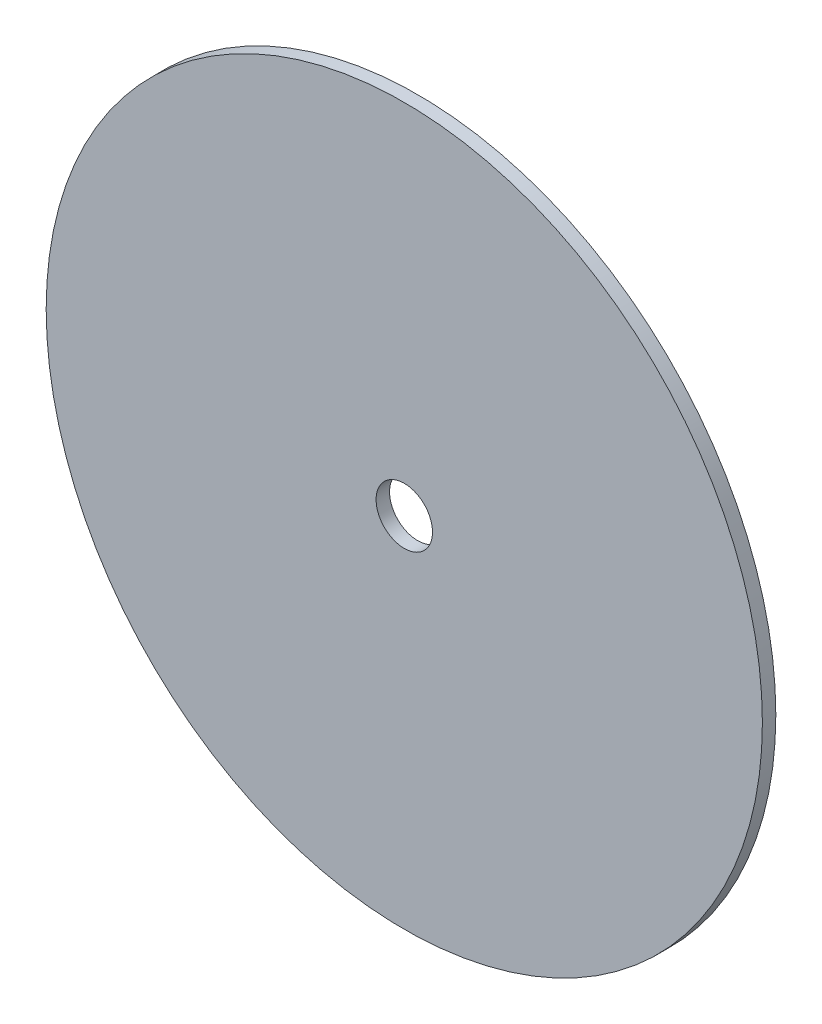
ISO-10303-21;
HEADER;
FILE_DESCRIPTION(('STEP AP214'),'2;1');
FILE_NAME('part.step','',(''),(''),'','','');
FILE_SCHEMA(('AUTOMOTIVE_DESIGN { 1 0 10303 214 1 1 1 1 }'));
ENDSEC;
DATA;
#1=APPLICATION_CONTEXT('core data for automotive mechanical design processes');
#2=APPLICATION_PROTOCOL_DEFINITION('international standard','automotive_design',2000,#1);
#3=PRODUCT_CONTEXT('',#1,'mechanical');
#4=PRODUCT('Part','Part','',(#3));
#5=PRODUCT_RELATED_PRODUCT_CATEGORY('part','',(#4));
#6=PRODUCT_DEFINITION_FORMATION('','',#4);
#7=PRODUCT_DEFINITION_CONTEXT('part definition',#1,'design');
#8=PRODUCT_DEFINITION('design','',#6,#7);
#9=PRODUCT_DEFINITION_SHAPE('','',#8);
#10=(LENGTH_UNIT() NAMED_UNIT(*) SI_UNIT(.MILLI.,.METRE.));
#11=(NAMED_UNIT(*) PLANE_ANGLE_UNIT() SI_UNIT($,.RADIAN.));
#12=(NAMED_UNIT(*) SI_UNIT($,.STERADIAN.) SOLID_ANGLE_UNIT());
#13=UNCERTAINTY_MEASURE_WITH_UNIT(LENGTH_MEASURE(1.E-05),#10,'distance_accuracy_value','');
#14=(GEOMETRIC_REPRESENTATION_CONTEXT(3) GLOBAL_UNCERTAINTY_ASSIGNED_CONTEXT((#13)) GLOBAL_UNIT_ASSIGNED_CONTEXT((#10,
#11,#12)) REPRESENTATION_CONTEXT('',''));
#15=CARTESIAN_POINT('',(0.,0.,0.));
#16=DIRECTION('',(0.,0.,1.));
#17=DIRECTION('',(1.,0.,0.));
#18=AXIS2_PLACEMENT_3D('',#15,#16,#17);
#19=CARTESIAN_POINT('',(0.,0.,6.));
#20=DIRECTION('',(0.,0.,1.));
#21=DIRECTION('',(1.,0.,0.));
#22=AXIS2_PLACEMENT_3D('',#19,#20,#21);
#23=PLANE('',#22);
#24=CARTESIAN_POINT('',(0.,0.,6.));
#25=DIRECTION('',(0.,0.,1.));
#26=DIRECTION('',(1.,0.,0.));
#27=AXIS2_PLACEMENT_3D('',#24,#25,#26);
#28=CIRCLE('',#27,160.);
#29=CARTESIAN_POINT('',(160.,0.,6.));
#30=VERTEX_POINT('',#29);
#31=EDGE_CURVE('E10',#30,#30,#28,.T.);
#32=ORIENTED_EDGE('',*,*,#31,.T.);
#33=EDGE_LOOP('',(#32));
#34=FACE_BOUND('',#33,.T.);
#35=CARTESIAN_POINT('',(0.,0.,6.));
#36=DIRECTION('',(0.,0.,1.));
#37=DIRECTION('',(1.,0.,0.));
#38=AXIS2_PLACEMENT_3D('',#35,#36,#37);
#39=CIRCLE('',#38,12.6);
#40=CARTESIAN_POINT('',(12.6,0.,6.));
#41=VERTEX_POINT('',#40);
#42=EDGE_CURVE('E42',#41,#41,#39,.T.);
#43=ORIENTED_EDGE('',*,*,#42,.F.);
#44=EDGE_LOOP('',(#43));
#45=FACE_BOUND('',#44,.T.);
#46=ADVANCED_FACE('F31',(#34,#45),#23,.T.);
#47=CARTESIAN_POINT('',(0.,0.,0.));
#48=DIRECTION('',(0.,0.,1.));
#49=DIRECTION('',(1.,0.,0.));
#50=AXIS2_PLACEMENT_3D('',#47,#48,#49);
#51=PLANE('',#50);
#52=CARTESIAN_POINT('',(0.,0.,0.));
#53=DIRECTION('',(0.,0.,1.));
#54=DIRECTION('',(1.,0.,0.));
#55=AXIS2_PLACEMENT_3D('',#52,#53,#54);
#56=CIRCLE('',#55,160.);
#57=CARTESIAN_POINT('',(160.,0.,0.));
#58=VERTEX_POINT('',#57);
#59=EDGE_CURVE('E35',#58,#58,#56,.T.);
#60=ORIENTED_EDGE('',*,*,#59,.F.);
#61=EDGE_LOOP('',(#60));
#62=FACE_BOUND('',#61,.T.);
#63=CARTESIAN_POINT('',(0.,0.,0.));
#64=DIRECTION('',(0.,0.,1.));
#65=DIRECTION('',(1.,0.,0.));
#66=AXIS2_PLACEMENT_3D('',#63,#64,#65);
#67=CIRCLE('',#66,12.6);
#68=CARTESIAN_POINT('',(12.6,0.,0.));
#69=VERTEX_POINT('',#68);
#70=EDGE_CURVE('E44',#69,#69,#67,.T.);
#71=ORIENTED_EDGE('',*,*,#70,.T.);
#72=EDGE_LOOP('',(#71));
#73=FACE_BOUND('',#72,.T.);
#74=ADVANCED_FACE('F54',(#62,#73),#51,.F.);
#75=CARTESIAN_POINT('',(0.,0.,6.));
#76=DIRECTION('',(0.,0.,-1.));
#77=DIRECTION('',(-1.,0.,0.));
#78=AXIS2_PLACEMENT_3D('',#75,#76,#77);
#79=CYLINDRICAL_SURFACE('',#78,160.);
#80=ORIENTED_EDGE('',*,*,#31,.F.);
#81=EDGE_LOOP('',(#80));
#82=FACE_BOUND('',#81,.T.);
#83=ORIENTED_EDGE('',*,*,#59,.T.);
#84=EDGE_LOOP('',(#83));
#85=FACE_BOUND('',#84,.T.);
#86=ADVANCED_FACE('F33',(#82,#85),#79,.T.);
#87=CARTESIAN_POINT('',(0.,0.,6.));
#88=DIRECTION('',(0.,0.,-1.));
#89=DIRECTION('',(-1.,0.,0.));
#90=AXIS2_PLACEMENT_3D('',#87,#88,#89);
#91=CYLINDRICAL_SURFACE('',#90,12.6);
#92=ORIENTED_EDGE('',*,*,#42,.T.);
#93=EDGE_LOOP('',(#92));
#94=FACE_BOUND('',#93,.T.);
#95=ORIENTED_EDGE('',*,*,#70,.F.);
#96=EDGE_LOOP('',(#95));
#97=FACE_BOUND('',#96,.T.);
#98=ADVANCED_FACE('F50',(#94,#97),#91,.F.);
#99=CLOSED_SHELL('',(#46,#74,#86,#98));
#100=MANIFOLD_SOLID_BREP('B2',#99);
#101=ADVANCED_BREP_SHAPE_REPRESENTATION('',(#18,#100),#14);
#102=SHAPE_DEFINITION_REPRESENTATION(#9,#101);
ENDSEC;
END-ISO-10303-21;
